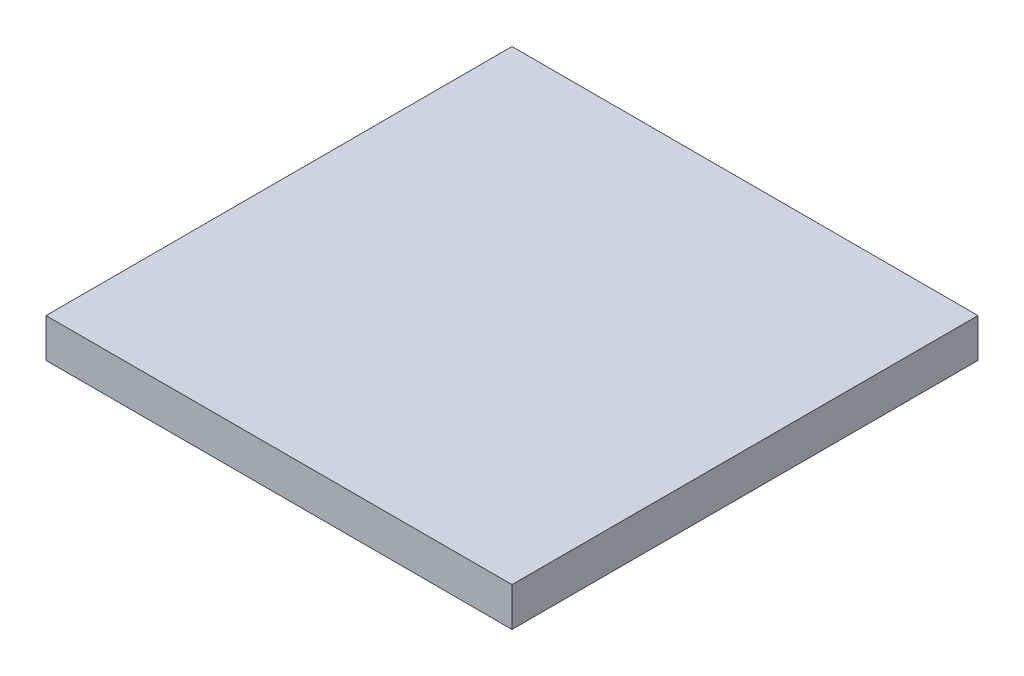
ISO-10303-21;
HEADER;
FILE_DESCRIPTION(('STEP AP214'),'2;1');
FILE_NAME('part.step','',(''),(''),'','','');
FILE_SCHEMA(('AUTOMOTIVE_DESIGN { 1 0 10303 214 1 1 1 1 }'));
ENDSEC;
DATA;
#1=APPLICATION_CONTEXT('core data for automotive mechanical design processes');
#2=APPLICATION_PROTOCOL_DEFINITION('international standard','automotive_design',2000,#1);
#3=PRODUCT_CONTEXT('',#1,'mechanical');
#4=PRODUCT('Part','Part','',(#3));
#5=PRODUCT_RELATED_PRODUCT_CATEGORY('part','',(#4));
#6=PRODUCT_DEFINITION_FORMATION('','',#4);
#7=PRODUCT_DEFINITION_CONTEXT('part definition',#1,'design');
#8=PRODUCT_DEFINITION('design','',#6,#7);
#9=PRODUCT_DEFINITION_SHAPE('','',#8);
#10=(LENGTH_UNIT() NAMED_UNIT(*) SI_UNIT(.MILLI.,.METRE.));
#11=(NAMED_UNIT(*) PLANE_ANGLE_UNIT() SI_UNIT($,.RADIAN.));
#12=(NAMED_UNIT(*) SI_UNIT($,.STERADIAN.) SOLID_ANGLE_UNIT());
#13=UNCERTAINTY_MEASURE_WITH_UNIT(LENGTH_MEASURE(1.E-05),#10,'distance_accuracy_value','');
#14=(GEOMETRIC_REPRESENTATION_CONTEXT(3) GLOBAL_UNCERTAINTY_ASSIGNED_CONTEXT((#13)) GLOBAL_UNIT_ASSIGNED_CONTEXT((#10,
#11,#12)) REPRESENTATION_CONTEXT('',''));
#15=CARTESIAN_POINT('',(0.,0.,0.));
#16=DIRECTION('',(0.,0.,1.));
#17=DIRECTION('',(1.,0.,0.));
#18=AXIS2_PLACEMENT_3D('',#15,#16,#17);
#19=CARTESIAN_POINT('',(38.1,3.175,0.));
#20=DIRECTION('',(-1.,0.,0.));
#21=DIRECTION('',(0.,0.,-1.));
#22=AXIS2_PLACEMENT_3D('',#19,#20,#21);
#23=PLANE('',#22);
#24=DIRECTION('',(0.,1.,0.));
#25=VECTOR('',#24,1.);
#26=CARTESIAN_POINT('',(38.1,3.175,0.));
#27=LINE('',#26,#25);
#28=CARTESIAN_POINT('',(38.1,0.,0.));
#29=VERTEX_POINT('',#28);
#30=CARTESIAN_POINT('',(38.1,3.175,0.));
#31=VERTEX_POINT('',#30);
#32=EDGE_CURVE('E11',#29,#31,#27,.T.);
#33=ORIENTED_EDGE('',*,*,#32,.F.);
#34=DIRECTION('',(0.,0.,-1.));
#35=VECTOR('',#34,1.);
#36=CARTESIAN_POINT('',(38.1,0.,0.));
#37=LINE('',#36,#35);
#38=CARTESIAN_POINT('',(38.1,0.,-38.1));
#39=VERTEX_POINT('',#38);
#40=EDGE_CURVE('E93',#29,#39,#37,.T.);
#41=ORIENTED_EDGE('',*,*,#40,.T.);
#42=DIRECTION('',(0.,1.,0.));
#43=VECTOR('',#42,1.);
#44=CARTESIAN_POINT('',(38.1,3.175,-38.1));
#45=LINE('',#44,#43);
#46=CARTESIAN_POINT('',(38.1,3.175,-38.1));
#47=VERTEX_POINT('',#46);
#48=EDGE_CURVE('E49',#39,#47,#45,.T.);
#49=ORIENTED_EDGE('',*,*,#48,.T.);
#50=DIRECTION('',(0.,0.,-1.));
#51=VECTOR('',#50,1.);
#52=CARTESIAN_POINT('',(38.1,3.175,0.));
#53=LINE('',#52,#51);
#54=EDGE_CURVE('E106',#31,#47,#53,.T.);
#55=ORIENTED_EDGE('',*,*,#54,.F.);
#56=EDGE_LOOP('',(#33,#41,#49,#55));
#57=FACE_BOUND('',#56,.T.);
#58=ADVANCED_FACE('F39',(#57),#23,.F.);
#59=CARTESIAN_POINT('',(0.,3.175,-38.1));
#60=DIRECTION('',(0.,0.,1.));
#61=DIRECTION('',(-1.,0.,0.));
#62=AXIS2_PLACEMENT_3D('',#59,#60,#61);
#63=PLANE('',#62);
#64=ORIENTED_EDGE('',*,*,#48,.F.);
#65=DIRECTION('',(1.,0.,0.));
#66=VECTOR('',#65,1.);
#67=CARTESIAN_POINT('',(0.,0.,-38.1));
#68=LINE('',#67,#66);
#69=CARTESIAN_POINT('',(0.,0.,-38.1));
#70=VERTEX_POINT('',#69);
#71=EDGE_CURVE('E100',#39,#70,#68,.F.);
#72=ORIENTED_EDGE('',*,*,#71,.T.);
#73=DIRECTION('',(0.,1.,0.));
#74=VECTOR('',#73,1.);
#75=CARTESIAN_POINT('',(0.,3.175,-38.1));
#76=LINE('',#75,#74);
#77=CARTESIAN_POINT('',(0.,3.175,-38.1));
#78=VERTEX_POINT('',#77);
#79=EDGE_CURVE('E57',#70,#78,#76,.T.);
#80=ORIENTED_EDGE('',*,*,#79,.T.);
#81=DIRECTION('',(-1.,0.,0.));
#82=VECTOR('',#81,1.);
#83=CARTESIAN_POINT('',(0.,3.175,-38.1));
#84=LINE('',#83,#82);
#85=EDGE_CURVE('E87',#47,#78,#84,.T.);
#86=ORIENTED_EDGE('',*,*,#85,.F.);
#87=EDGE_LOOP('',(#64,#72,#80,#86));
#88=FACE_BOUND('',#87,.T.);
#89=ADVANCED_FACE('F110',(#88),#63,.F.);
#90=CARTESIAN_POINT('',(0.,3.175,0.));
#91=DIRECTION('',(1.,0.,0.));
#92=DIRECTION('',(0.,0.,1.));
#93=AXIS2_PLACEMENT_3D('',#90,#91,#92);
#94=PLANE('',#93);
#95=ORIENTED_EDGE('',*,*,#79,.F.);
#96=DIRECTION('',(0.,0.,-1.));
#97=VECTOR('',#96,1.);
#98=CARTESIAN_POINT('',(0.,0.,0.));
#99=LINE('',#98,#97);
#100=CARTESIAN_POINT('',(0.,0.,0.));
#101=VERTEX_POINT('',#100);
#102=EDGE_CURVE('E92',#70,#101,#99,.F.);
#103=ORIENTED_EDGE('',*,*,#102,.T.);
#104=DIRECTION('',(0.,1.,0.));
#105=VECTOR('',#104,1.);
#106=CARTESIAN_POINT('',(0.,3.175,0.));
#107=LINE('',#106,#105);
#108=CARTESIAN_POINT('',(0.,3.175,0.));
#109=VERTEX_POINT('',#108);
#110=EDGE_CURVE('E43',#101,#109,#107,.T.);
#111=ORIENTED_EDGE('',*,*,#110,.T.);
#112=DIRECTION('',(0.,0.,1.));
#113=VECTOR('',#112,1.);
#114=CARTESIAN_POINT('',(0.,3.175,0.));
#115=LINE('',#114,#113);
#116=EDGE_CURVE('E102',#78,#109,#115,.T.);
#117=ORIENTED_EDGE('',*,*,#116,.F.);
#118=EDGE_LOOP('',(#95,#103,#111,#117));
#119=FACE_BOUND('',#118,.T.);
#120=ADVANCED_FACE('F95',(#119),#94,.F.);
#121=CARTESIAN_POINT('',(0.,3.175,0.));
#122=DIRECTION('',(0.,0.,-1.));
#123=DIRECTION('',(1.,0.,0.));
#124=AXIS2_PLACEMENT_3D('',#121,#122,#123);
#125=PLANE('',#124);
#126=DIRECTION('',(1.,0.,0.));
#127=VECTOR('',#126,1.);
#128=CARTESIAN_POINT('',(0.,0.,0.));
#129=LINE('',#128,#127);
#130=EDGE_CURVE('E81',#101,#29,#129,.T.);
#131=ORIENTED_EDGE('',*,*,#130,.T.);
#132=ORIENTED_EDGE('',*,*,#32,.T.);
#133=DIRECTION('',(1.,0.,0.));
#134=VECTOR('',#133,1.);
#135=CARTESIAN_POINT('',(0.,3.175,0.));
#136=LINE('',#135,#134);
#137=EDGE_CURVE('E83',#109,#31,#136,.T.);
#138=ORIENTED_EDGE('',*,*,#137,.F.);
#139=ORIENTED_EDGE('',*,*,#110,.F.);
#140=EDGE_LOOP('',(#131,#132,#138,#139));
#141=FACE_BOUND('',#140,.T.);
#142=ADVANCED_FACE('F41',(#141),#125,.F.);
#143=CARTESIAN_POINT('',(0.,3.175,0.));
#144=DIRECTION('',(0.,-1.,0.));
#145=DIRECTION('',(0.,0.,-1.));
#146=AXIS2_PLACEMENT_3D('',#143,#144,#145);
#147=PLANE('',#146);
#148=ORIENTED_EDGE('',*,*,#116,.T.);
#149=ORIENTED_EDGE('',*,*,#137,.T.);
#150=ORIENTED_EDGE('',*,*,#54,.T.);
#151=ORIENTED_EDGE('',*,*,#85,.T.);
#152=EDGE_LOOP('',(#148,#149,#150,#151));
#153=FACE_BOUND('',#152,.T.);
#154=ADVANCED_FACE('F109',(#153),#147,.F.);
#155=CARTESIAN_POINT('',(0.,0.,0.));
#156=DIRECTION('',(0.,-1.,0.));
#157=DIRECTION('',(0.,0.,-1.));
#158=AXIS2_PLACEMENT_3D('',#155,#156,#157);
#159=PLANE('',#158);
#160=ORIENTED_EDGE('',*,*,#102,.F.);
#161=ORIENTED_EDGE('',*,*,#71,.F.);
#162=ORIENTED_EDGE('',*,*,#40,.F.);
#163=ORIENTED_EDGE('',*,*,#130,.F.);
#164=EDGE_LOOP('',(#160,#161,#162,#163));
#165=FACE_BOUND('',#164,.T.);
#166=ADVANCED_FACE('F90',(#165),#159,.T.);
#167=CLOSED_SHELL('',(#58,#89,#120,#142,#154,#166));
#168=MANIFOLD_SOLID_BREP('B2',#167);
#169=ADVANCED_BREP_SHAPE_REPRESENTATION('',(#18,#168),#14);
#170=SHAPE_DEFINITION_REPRESENTATION(#9,#169);
ENDSEC;
END-ISO-10303-21;
